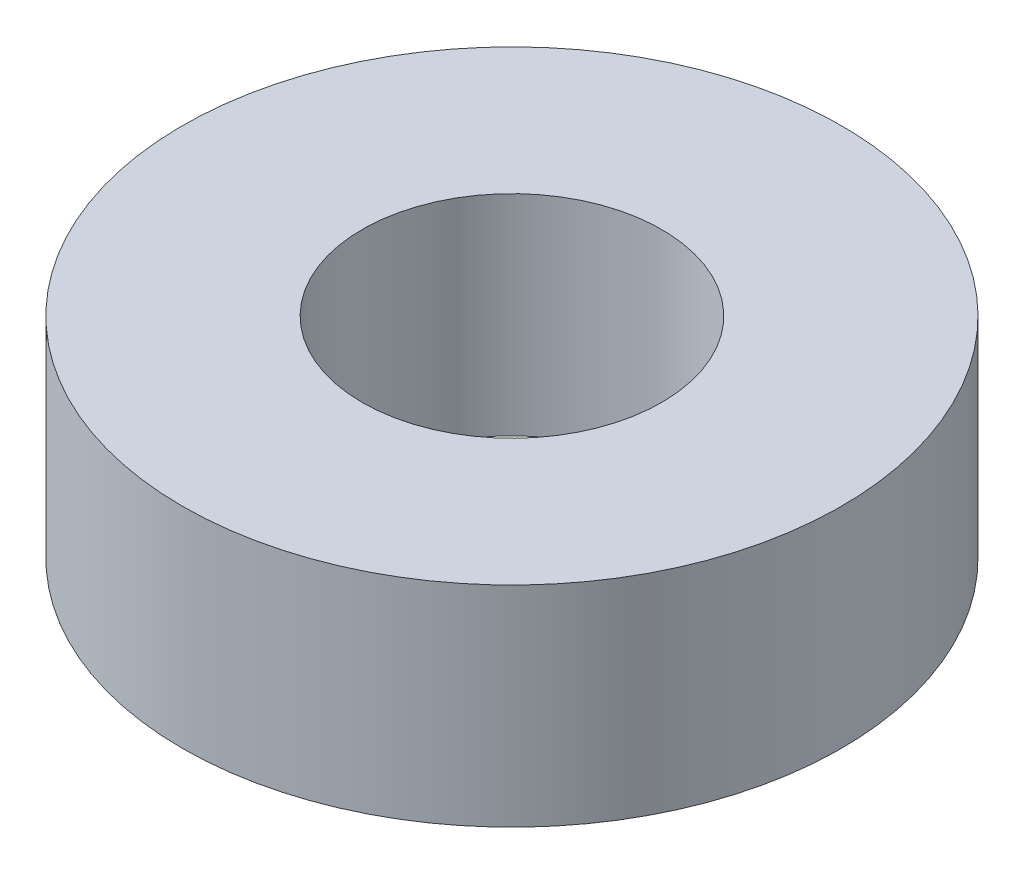
ISO-10303-21;
HEADER;
FILE_DESCRIPTION(('STEP AP214'),'2;1');
FILE_NAME('part.step','',(''),(''),'','','');
FILE_SCHEMA(('AUTOMOTIVE_DESIGN { 1 0 10303 214 1 1 1 1 }'));
ENDSEC;
DATA;
#1=APPLICATION_CONTEXT('core data for automotive mechanical design processes');
#2=APPLICATION_PROTOCOL_DEFINITION('international standard','automotive_design',2000,#1);
#3=PRODUCT_CONTEXT('',#1,'mechanical');
#4=PRODUCT('Part','Part','',(#3));
#5=PRODUCT_RELATED_PRODUCT_CATEGORY('part','',(#4));
#6=PRODUCT_DEFINITION_FORMATION('','',#4);
#7=PRODUCT_DEFINITION_CONTEXT('part definition',#1,'design');
#8=PRODUCT_DEFINITION('design','',#6,#7);
#9=PRODUCT_DEFINITION_SHAPE('','',#8);
#10=(LENGTH_UNIT() NAMED_UNIT(*) SI_UNIT(.MILLI.,.METRE.));
#11=(NAMED_UNIT(*) PLANE_ANGLE_UNIT() SI_UNIT($,.RADIAN.));
#12=(NAMED_UNIT(*) SI_UNIT($,.STERADIAN.) SOLID_ANGLE_UNIT());
#13=UNCERTAINTY_MEASURE_WITH_UNIT(LENGTH_MEASURE(1.E-05),#10,'distance_accuracy_value','');
#14=(GEOMETRIC_REPRESENTATION_CONTEXT(3) GLOBAL_UNCERTAINTY_ASSIGNED_CONTEXT((#13)) GLOBAL_UNIT_ASSIGNED_CONTEXT((#10,
#11,#12)) REPRESENTATION_CONTEXT('',''));
#15=CARTESIAN_POINT('',(0.,0.,0.));
#16=DIRECTION('',(0.,0.,1.));
#17=DIRECTION('',(1.,0.,0.));
#18=AXIS2_PLACEMENT_3D('',#15,#16,#17);
#19=CARTESIAN_POINT('',(0.,7.,0.));
#20=DIRECTION('',(0.,1.,0.));
#21=DIRECTION('',(0.,0.,1.));
#22=AXIS2_PLACEMENT_3D('',#19,#20,#21);
#23=PLANE('',#22);
#24=CARTESIAN_POINT('',(0.,7.,0.));
#25=DIRECTION('',(0.,1.,0.));
#26=DIRECTION('',(0.,0.,1.));
#27=AXIS2_PLACEMENT_3D('',#24,#25,#26);
#28=CIRCLE('',#27,11.);
#29=CARTESIAN_POINT('',(0.,7.,11.));
#30=VERTEX_POINT('',#29);
#31=EDGE_CURVE('E10',#30,#30,#28,.T.);
#32=ORIENTED_EDGE('',*,*,#31,.T.);
#33=EDGE_LOOP('',(#32));
#34=FACE_BOUND('',#33,.T.);
#35=CARTESIAN_POINT('',(0.,7.,0.));
#36=DIRECTION('',(0.,1.,0.));
#37=DIRECTION('',(0.,0.,1.));
#38=AXIS2_PLACEMENT_3D('',#35,#36,#37);
#39=CIRCLE('',#38,5.);
#40=CARTESIAN_POINT('',(0.,7.,5.));
#41=VERTEX_POINT('',#40);
#42=EDGE_CURVE('E50',#41,#41,#39,.T.);
#43=ORIENTED_EDGE('',*,*,#42,.F.);
#44=EDGE_LOOP('',(#43));
#45=FACE_BOUND('',#44,.T.);
#46=ADVANCED_FACE('F37',(#34,#45),#23,.T.);
#47=CARTESIAN_POINT('',(0.,0.,0.));
#48=DIRECTION('',(0.,1.,0.));
#49=DIRECTION('',(0.,0.,1.));
#50=AXIS2_PLACEMENT_3D('',#47,#48,#49);
#51=PLANE('',#50);
#52=CARTESIAN_POINT('',(0.,0.,0.));
#53=DIRECTION('',(0.,1.,0.));
#54=DIRECTION('',(0.,0.,1.));
#55=AXIS2_PLACEMENT_3D('',#52,#53,#54);
#56=CIRCLE('',#55,11.);
#57=CARTESIAN_POINT('',(0.,0.,11.));
#58=VERTEX_POINT('',#57);
#59=EDGE_CURVE('E41',#58,#58,#56,.T.);
#60=ORIENTED_EDGE('',*,*,#59,.F.);
#61=EDGE_LOOP('',(#60));
#62=FACE_BOUND('',#61,.T.);
#63=CARTESIAN_POINT('',(0.,0.,0.));
#64=DIRECTION('',(0.,1.,0.));
#65=DIRECTION('',(0.,0.,1.));
#66=AXIS2_PLACEMENT_3D('',#63,#64,#65);
#67=CIRCLE('',#66,5.);
#68=CARTESIAN_POINT('',(0.,0.,5.));
#69=VERTEX_POINT('',#68);
#70=EDGE_CURVE('E52',#69,#69,#67,.T.);
#71=ORIENTED_EDGE('',*,*,#70,.T.);
#72=EDGE_LOOP('',(#71));
#73=FACE_BOUND('',#72,.T.);
#74=ADVANCED_FACE('F64',(#62,#73),#51,.F.);
#75=CARTESIAN_POINT('',(0.,7.,0.));
#76=DIRECTION('',(0.,-1.,0.));
#77=DIRECTION('',(0.,0.,-1.));
#78=AXIS2_PLACEMENT_3D('',#75,#76,#77);
#79=CYLINDRICAL_SURFACE('',#78,11.);
#80=ORIENTED_EDGE('',*,*,#31,.F.);
#81=EDGE_LOOP('',(#80));
#82=FACE_BOUND('',#81,.T.);
#83=ORIENTED_EDGE('',*,*,#59,.T.);
#84=EDGE_LOOP('',(#83));
#85=FACE_BOUND('',#84,.T.);
#86=ADVANCED_FACE('F39',(#82,#85),#79,.T.);
#87=CARTESIAN_POINT('',(0.,7.,0.));
#88=DIRECTION('',(0.,-1.,0.));
#89=DIRECTION('',(0.,0.,-1.));
#90=AXIS2_PLACEMENT_3D('',#87,#88,#89);
#91=CYLINDRICAL_SURFACE('',#90,5.);
#92=ORIENTED_EDGE('',*,*,#42,.T.);
#93=EDGE_LOOP('',(#92));
#94=FACE_BOUND('',#93,.T.);
#95=ORIENTED_EDGE('',*,*,#70,.F.);
#96=EDGE_LOOP('',(#95));
#97=FACE_BOUND('',#96,.T.);
#98=ADVANCED_FACE('F60',(#94,#97),#91,.F.);
#99=CLOSED_SHELL('',(#46,#74,#86,#98));
#100=MANIFOLD_SOLID_BREP('B2',#99);
#101=ADVANCED_BREP_SHAPE_REPRESENTATION('',(#18,#100),#14);
#102=SHAPE_DEFINITION_REPRESENTATION(#9,#101);
ENDSEC;
END-ISO-10303-21;
